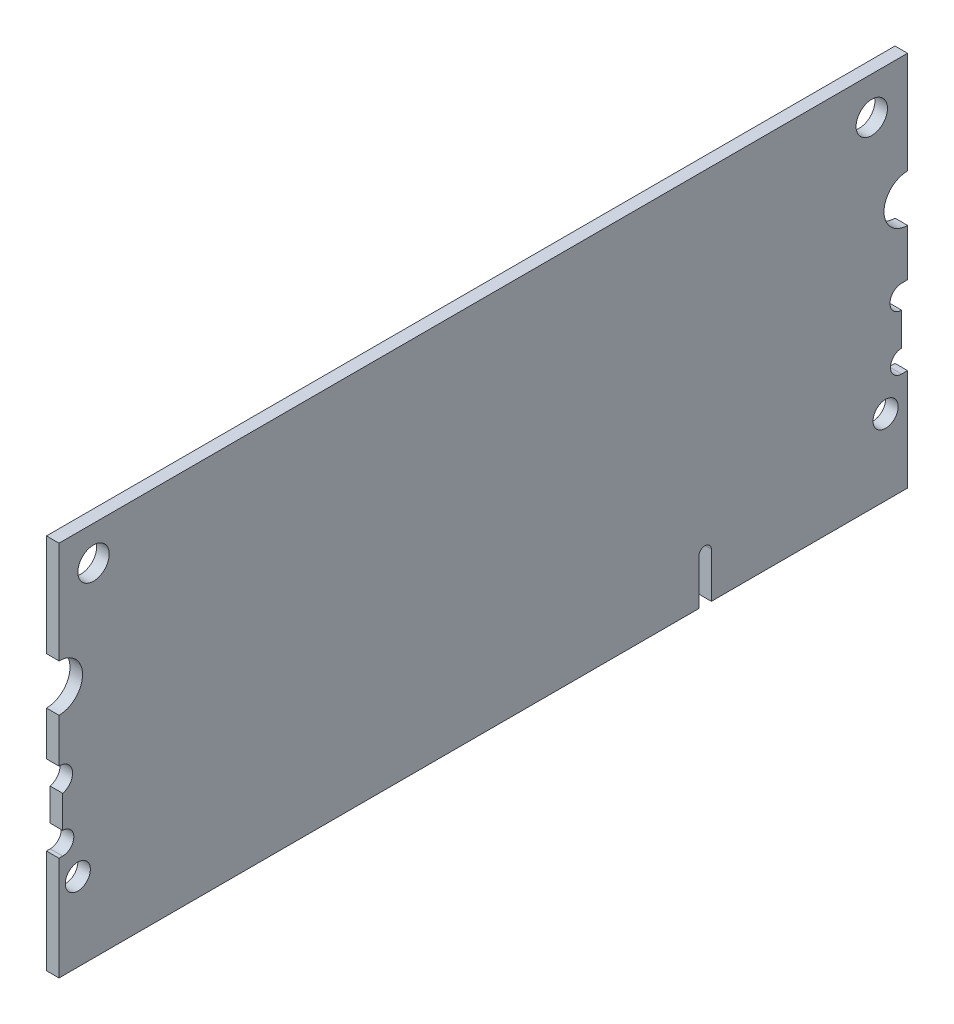
ISO-10303-21;
HEADER;
FILE_DESCRIPTION(('STEP AP214'),'2;1');
FILE_NAME('part.step','',(''),(''),'','','');
FILE_SCHEMA(('AUTOMOTIVE_DESIGN { 1 0 10303 214 1 1 1 1 }'));
ENDSEC;
DATA;
#1=APPLICATION_CONTEXT('core data for automotive mechanical design processes');
#2=APPLICATION_PROTOCOL_DEFINITION('international standard','automotive_design',2000,#1);
#3=PRODUCT_CONTEXT('',#1,'mechanical');
#4=PRODUCT('Part','Part','',(#3));
#5=PRODUCT_RELATED_PRODUCT_CATEGORY('part','',(#4));
#6=PRODUCT_DEFINITION_FORMATION('','',#4);
#7=PRODUCT_DEFINITION_CONTEXT('part definition',#1,'design');
#8=PRODUCT_DEFINITION('design','',#6,#7);
#9=PRODUCT_DEFINITION_SHAPE('','',#8);
#10=(LENGTH_UNIT() NAMED_UNIT(*) SI_UNIT(.MILLI.,.METRE.));
#11=(NAMED_UNIT(*) PLANE_ANGLE_UNIT() SI_UNIT($,.RADIAN.));
#12=(NAMED_UNIT(*) SI_UNIT($,.STERADIAN.) SOLID_ANGLE_UNIT());
#13=UNCERTAINTY_MEASURE_WITH_UNIT(LENGTH_MEASURE(1.E-05),#10,'distance_accuracy_value','');
#14=(GEOMETRIC_REPRESENTATION_CONTEXT(3) GLOBAL_UNCERTAINTY_ASSIGNED_CONTEXT((#13)) GLOBAL_UNIT_ASSIGNED_CONTEXT((#10,
#11,#12)) REPRESENTATION_CONTEXT('',''));
#15=CARTESIAN_POINT('',(0.,0.,0.));
#16=DIRECTION('',(0.,0.,1.));
#17=DIRECTION('',(1.,0.,0.));
#18=AXIS2_PLACEMENT_3D('',#15,#16,#17);
#19=CARTESIAN_POINT('',(0.,20.,-67.6));
#20=DIRECTION('',(1.,0.,0.));
#21=DIRECTION('',(0.,0.,-1.));
#22=AXIS2_PLACEMENT_3D('',#19,#20,#21);
#23=CYLINDRICAL_SURFACE('',#22,1.875);
#24=DIRECTION('',(-1.,0.,0.));
#25=VECTOR('',#24,1.);
#26=CARTESIAN_POINT('',(0.,21.875,-67.6));
#27=LINE('',#26,#25);
#28=CARTESIAN_POINT('',(1.,21.875,-67.6));
#29=VERTEX_POINT('',#28);
#30=CARTESIAN_POINT('',(0.,21.875,-67.6));
#31=VERTEX_POINT('',#30);
#32=EDGE_CURVE('E213',#29,#31,#27,.T.);
#33=ORIENTED_EDGE('',*,*,#32,.F.);
#34=CARTESIAN_POINT('',(1.,20.,-67.6));
#35=DIRECTION('',(-1.,0.,0.));
#36=DIRECTION('',(0.,0.,-1.));
#37=AXIS2_PLACEMENT_3D('',#34,#35,#36);
#38=CIRCLE('',#37,1.875);
#39=CARTESIAN_POINT('',(1.,18.125,-67.6));
#40=VERTEX_POINT('',#39);
#41=EDGE_CURVE('E68',#40,#29,#38,.T.);
#42=ORIENTED_EDGE('',*,*,#41,.F.);
#43=DIRECTION('',(1.,0.,0.));
#44=VECTOR('',#43,1.);
#45=CARTESIAN_POINT('',(0.,18.125,-67.6));
#46=LINE('',#45,#44);
#47=CARTESIAN_POINT('',(0.,18.125,-67.6));
#48=VERTEX_POINT('',#47);
#49=EDGE_CURVE('E306',#48,#40,#46,.T.);
#50=ORIENTED_EDGE('',*,*,#49,.F.);
#51=CARTESIAN_POINT('',(0.,20.,-67.6));
#52=DIRECTION('',(1.,0.,0.));
#53=DIRECTION('',(0.,0.,-1.));
#54=AXIS2_PLACEMENT_3D('',#51,#52,#53);
#55=CIRCLE('',#54,1.875);
#56=EDGE_CURVE('E211',#31,#48,#55,.T.);
#57=ORIENTED_EDGE('',*,*,#56,.F.);
#58=EDGE_LOOP('',(#33,#42,#50,#57));
#59=FACE_BOUND('',#58,.T.);
#60=ADVANCED_FACE('F44',(#59),#23,.F.);
#61=CARTESIAN_POINT('',(0.,27.25,-2.75));
#62=DIRECTION('',(1.,0.,0.));
#63=DIRECTION('',(0.,0.,-1.));
#64=AXIS2_PLACEMENT_3D('',#61,#62,#63);
#65=CYLINDRICAL_SURFACE('',#64,1.25);
#66=CARTESIAN_POINT('',(1.,27.25,-2.75));
#67=DIRECTION('',(-1.,0.,0.));
#68=DIRECTION('',(0.,0.,-1.));
#69=AXIS2_PLACEMENT_3D('',#66,#67,#68);
#70=CIRCLE('',#69,1.25);
#71=CARTESIAN_POINT('',(1.,27.25,-1.5));
#72=VERTEX_POINT('',#71);
#73=EDGE_CURVE('E313',#72,#72,#70,.T.);
#74=ORIENTED_EDGE('',*,*,#73,.F.);
#75=EDGE_LOOP('',(#74));
#76=FACE_BOUND('',#75,.T.);
#77=CARTESIAN_POINT('',(0.,27.25,-2.75));
#78=DIRECTION('',(1.,0.,0.));
#79=DIRECTION('',(0.,0.,-1.));
#80=AXIS2_PLACEMENT_3D('',#77,#78,#79);
#81=CIRCLE('',#80,1.25);
#82=CARTESIAN_POINT('',(0.,27.25,-1.5));
#83=VERTEX_POINT('',#82);
#84=EDGE_CURVE('E310',#83,#83,#81,.T.);
#85=ORIENTED_EDGE('',*,*,#84,.F.);
#86=EDGE_LOOP('',(#85));
#87=FACE_BOUND('',#86,.T.);
#88=ADVANCED_FACE('F656',(#76,#87),#65,.F.);
#89=CARTESIAN_POINT('',(0.,3.59452729188019,-51.4698211262183));
#90=DIRECTION('',(1.,0.,0.));
#91=DIRECTION('',(0.,0.,1.));
#92=AXIS2_PLACEMENT_3D('',#89,#90,#91);
#93=CYLINDRICAL_SURFACE('',#92,0.500496891437328);
#94=CARTESIAN_POINT('',(0.,3.59452729188019,-51.4698211262183));
#95=DIRECTION('',(1.,0.,0.));
#96=DIRECTION('',(0.,0.,1.));
#97=AXIS2_PLACEMENT_3D('',#94,#95,#96);
#98=CIRCLE('',#97,0.500496891437328);
#99=CARTESIAN_POINT('',(0.,3.59452729188019,-51.9703180176556));
#100=VERTEX_POINT('',#99);
#101=CARTESIAN_POINT('',(0.,3.59452729188019,-50.969324234781));
#102=VERTEX_POINT('',#101);
#103=EDGE_CURVE('E227',#100,#102,#98,.T.);
#104=ORIENTED_EDGE('',*,*,#103,.F.);
#105=DIRECTION('',(1.,0.,0.));
#106=VECTOR('',#105,1.);
#107=CARTESIAN_POINT('',(0.,3.59452729188019,-51.9703180176556));
#108=LINE('',#107,#106);
#109=CARTESIAN_POINT('',(1.,3.59452729188019,-51.9703180176556));
#110=VERTEX_POINT('',#109);
#111=EDGE_CURVE('E11',#100,#110,#108,.T.);
#112=ORIENTED_EDGE('',*,*,#111,.T.);
#113=CARTESIAN_POINT('',(1.,3.59452729188019,-51.4698211262183));
#114=DIRECTION('',(-1.,0.,0.));
#115=DIRECTION('',(0.,0.,1.));
#116=AXIS2_PLACEMENT_3D('',#113,#114,#115);
#117=CIRCLE('',#116,0.500496891437328);
#118=CARTESIAN_POINT('',(1.,3.59452729188019,-50.969324234781));
#119=VERTEX_POINT('',#118);
#120=EDGE_CURVE('E176',#119,#110,#117,.T.);
#121=ORIENTED_EDGE('',*,*,#120,.F.);
#122=DIRECTION('',(1.,0.,0.));
#123=VECTOR('',#122,1.);
#124=CARTESIAN_POINT('',(0.,3.59452729188019,-50.969324234781));
#125=LINE('',#124,#123);
#126=EDGE_CURVE('E55',#102,#119,#125,.T.);
#127=ORIENTED_EDGE('',*,*,#126,.F.);
#128=EDGE_LOOP('',(#104,#112,#121,#127));
#129=FACE_BOUND('',#128,.T.);
#130=ADVANCED_FACE('F661',(#129),#93,.F.);
#131=CARTESIAN_POINT('',(0.,0.,-51.9703180176556));
#132=DIRECTION('',(0.,0.,-1.));
#133=DIRECTION('',(0.,-1.,0.));
#134=AXIS2_PLACEMENT_3D('',#131,#132,#133);
#135=PLANE('',#134);
#136=DIRECTION('',(0.,1.,0.));
#137=VECTOR('',#136,1.);
#138=CARTESIAN_POINT('',(0.,7.5,-51.9703180176556));
#139=LINE('',#138,#137);
#140=CARTESIAN_POINT('',(0.,0.,-51.9703180176556));
#141=VERTEX_POINT('',#140);
#142=EDGE_CURVE('E185',#141,#100,#139,.T.);
#143=ORIENTED_EDGE('',*,*,#142,.F.);
#144=DIRECTION('',(-1.,0.,0.));
#145=VECTOR('',#144,1.);
#146=CARTESIAN_POINT('',(0.,0.,-51.9703180176556));
#147=LINE('',#146,#145);
#148=CARTESIAN_POINT('',(1.,0.,-51.9703180176556));
#149=VERTEX_POINT('',#148);
#150=EDGE_CURVE('E182',#149,#141,#147,.T.);
#151=ORIENTED_EDGE('',*,*,#150,.F.);
#152=DIRECTION('',(0.,-1.,0.));
#153=VECTOR('',#152,1.);
#154=CARTESIAN_POINT('',(1.,7.5,-51.9703180176556));
#155=LINE('',#154,#153);
#156=EDGE_CURVE('E167',#110,#149,#155,.T.);
#157=ORIENTED_EDGE('',*,*,#156,.F.);
#158=ORIENTED_EDGE('',*,*,#111,.F.);
#159=EDGE_LOOP('',(#143,#151,#157,#158));
#160=FACE_BOUND('',#159,.T.);
#161=ADVANCED_FACE('F183',(#160),#135,.F.);
#162=CARTESIAN_POINT('',(0.,3.59452729188019,-50.969324234781));
#163=DIRECTION('',(0.,0.,1.));
#164=DIRECTION('',(1.,0.,0.));
#165=AXIS2_PLACEMENT_3D('',#162,#163,#164);
#166=PLANE('',#165);
#167=DIRECTION('',(0.,-1.,0.));
#168=VECTOR('',#167,1.);
#169=CARTESIAN_POINT('',(0.,9.2972636459401,-50.969324234781));
#170=LINE('',#169,#168);
#171=CARTESIAN_POINT('',(0.,0.,-50.969324234781));
#172=VERTEX_POINT('',#171);
#173=EDGE_CURVE('E269',#102,#172,#170,.T.);
#174=ORIENTED_EDGE('',*,*,#173,.F.);
#175=ORIENTED_EDGE('',*,*,#126,.T.);
#176=DIRECTION('',(0.,1.,0.));
#177=VECTOR('',#176,1.);
#178=CARTESIAN_POINT('',(1.,9.2972636459401,-50.969324234781));
#179=LINE('',#178,#177);
#180=CARTESIAN_POINT('',(1.,0.,-50.969324234781));
#181=VERTEX_POINT('',#180);
#182=EDGE_CURVE('E48',#181,#119,#179,.T.);
#183=ORIENTED_EDGE('',*,*,#182,.F.);
#184=DIRECTION('',(1.,0.,0.));
#185=VECTOR('',#184,1.);
#186=CARTESIAN_POINT('',(0.,0.,-50.969324234781));
#187=LINE('',#186,#185);
#188=EDGE_CURVE('E245',#172,#181,#187,.T.);
#189=ORIENTED_EDGE('',*,*,#188,.F.);
#190=EDGE_LOOP('',(#174,#175,#183,#189));
#191=FACE_BOUND('',#190,.T.);
#192=ADVANCED_FACE('F693',(#191),#166,.F.);
#193=CARTESIAN_POINT('',(0.,6.,-65.85));
#194=DIRECTION('',(1.,0.,0.));
#195=DIRECTION('',(0.,0.,-1.));
#196=AXIS2_PLACEMENT_3D('',#193,#194,#195);
#197=CYLINDRICAL_SURFACE('',#196,1.);
#198=CARTESIAN_POINT('',(1.,6.,-65.85));
#199=DIRECTION('',(-1.,0.,0.));
#200=DIRECTION('',(0.,0.,-1.));
#201=AXIS2_PLACEMENT_3D('',#198,#199,#200);
#202=CIRCLE('',#201,1.);
#203=CARTESIAN_POINT('',(1.,6.,-64.85));
#204=VERTEX_POINT('',#203);
#205=EDGE_CURVE('E317',#204,#204,#202,.T.);
#206=ORIENTED_EDGE('',*,*,#205,.F.);
#207=EDGE_LOOP('',(#206));
#208=FACE_BOUND('',#207,.T.);
#209=CARTESIAN_POINT('',(0.,6.,-65.85));
#210=DIRECTION('',(1.,0.,0.));
#211=DIRECTION('',(0.,0.,-1.));
#212=AXIS2_PLACEMENT_3D('',#209,#210,#211);
#213=CIRCLE('',#212,1.);
#214=CARTESIAN_POINT('',(0.,6.,-64.85));
#215=VERTEX_POINT('',#214);
#216=EDGE_CURVE('E353',#215,#215,#213,.T.);
#217=ORIENTED_EDGE('',*,*,#216,.F.);
#218=EDGE_LOOP('',(#217));
#219=FACE_BOUND('',#218,.T.);
#220=ADVANCED_FACE('F677',(#208,#219),#197,.F.);
#221=CARTESIAN_POINT('',(0.,6.25,-1.5));
#222=DIRECTION('',(1.,0.,0.));
#223=DIRECTION('',(0.,0.,-1.));
#224=AXIS2_PLACEMENT_3D('',#221,#222,#223);
#225=CYLINDRICAL_SURFACE('',#224,1.);
#226=CARTESIAN_POINT('',(1.,6.25,-1.5));
#227=DIRECTION('',(-1.,0.,0.));
#228=DIRECTION('',(0.,0.,-1.));
#229=AXIS2_PLACEMENT_3D('',#226,#227,#228);
#230=CIRCLE('',#229,1.);
#231=CARTESIAN_POINT('',(1.,6.25,-0.5));
#232=VERTEX_POINT('',#231);
#233=EDGE_CURVE('E403',#232,#232,#230,.T.);
#234=ORIENTED_EDGE('',*,*,#233,.F.);
#235=EDGE_LOOP('',(#234));
#236=FACE_BOUND('',#235,.T.);
#237=CARTESIAN_POINT('',(0.,6.25,-1.5));
#238=DIRECTION('',(1.,0.,0.));
#239=DIRECTION('',(0.,0.,-1.));
#240=AXIS2_PLACEMENT_3D('',#237,#238,#239);
#241=CIRCLE('',#240,1.);
#242=CARTESIAN_POINT('',(0.,6.25,-0.5));
#243=VERTEX_POINT('',#242);
#244=EDGE_CURVE('E349',#243,#243,#241,.T.);
#245=ORIENTED_EDGE('',*,*,#244,.F.);
#246=EDGE_LOOP('',(#245));
#247=FACE_BOUND('',#246,.T.);
#248=ADVANCED_FACE('F673',(#236,#247),#225,.F.);
#249=CARTESIAN_POINT('',(0.,14.6156215378988,-0.0558764284634614));
#250=DIRECTION('',(0.,1.,0.));
#251=DIRECTION('',(1.,0.,0.));
#252=AXIS2_PLACEMENT_3D('',#249,#250,#251);
#253=PLANE('',#252);
#254=DIRECTION('',(0.,0.,1.));
#255=VECTOR('',#254,1.);
#256=CARTESIAN_POINT('',(0.,14.6156215378988,-16.9279382142317));
#257=LINE('',#256,#255);
#258=CARTESIAN_POINT('',(0.,14.6156215378988,-0.0558764284634614));
#259=VERTEX_POINT('',#258);
#260=CARTESIAN_POINT('',(0.,14.6156215378988,0.));
#261=VERTEX_POINT('',#260);
#262=EDGE_CURVE('E426',#259,#261,#257,.T.);
#263=ORIENTED_EDGE('',*,*,#262,.F.);
#264=DIRECTION('',(1.,0.,0.));
#265=VECTOR('',#264,1.);
#266=CARTESIAN_POINT('',(0.,14.6156215378988,-0.0558764284634614));
#267=LINE('',#266,#265);
#268=CARTESIAN_POINT('',(1.,14.6156215378988,-0.0558764284634614));
#269=VERTEX_POINT('',#268);
#270=EDGE_CURVE('E237',#259,#269,#267,.T.);
#271=ORIENTED_EDGE('',*,*,#270,.T.);
#272=DIRECTION('',(0.,0.,-1.));
#273=VECTOR('',#272,1.);
#274=CARTESIAN_POINT('',(1.,14.6156215378988,-16.9279382142317));
#275=LINE('',#274,#273);
#276=CARTESIAN_POINT('',(1.,14.6156215378988,0.));
#277=VERTEX_POINT('',#276);
#278=EDGE_CURVE('E228',#277,#269,#275,.T.);
#279=ORIENTED_EDGE('',*,*,#278,.F.);
#280=DIRECTION('',(1.,0.,0.));
#281=VECTOR('',#280,1.);
#282=CARTESIAN_POINT('',(0.,14.6156215378988,0.));
#283=LINE('',#282,#281);
#284=EDGE_CURVE('E241',#261,#277,#283,.T.);
#285=ORIENTED_EDGE('',*,*,#284,.F.);
#286=EDGE_LOOP('',(#263,#271,#279,#285));
#287=FACE_BOUND('',#286,.T.);
#288=ADVANCED_FACE('F676',(#287),#253,.F.);
#289=CARTESIAN_POINT('',(0.,13.5910572090062,-0.0558764284634613));
#290=DIRECTION('',(1.,0.,0.));
#291=DIRECTION('',(0.,1.,0.));
#292=AXIS2_PLACEMENT_3D('',#289,#290,#291);
#293=CYLINDRICAL_SURFACE('',#292,1.02456432889257);
#294=CARTESIAN_POINT('',(0.,13.5910572090062,-0.0558764284634613));
#295=DIRECTION('',(1.,0.,0.));
#296=DIRECTION('',(0.,1.,0.));
#297=AXIS2_PLACEMENT_3D('',#294,#295,#296);
#298=CIRCLE('',#297,1.02456432889257);
#299=CARTESIAN_POINT('',(0.,12.594860961696,-0.295303037018298));
#300=VERTEX_POINT('',#299);
#301=EDGE_CURVE('E286',#300,#259,#298,.T.);
#302=ORIENTED_EDGE('',*,*,#301,.F.);
#303=DIRECTION('',(1.,0.,0.));
#304=VECTOR('',#303,1.);
#305=CARTESIAN_POINT('',(0.,12.594860961696,-0.295303037018298));
#306=LINE('',#305,#304);
#307=CARTESIAN_POINT('',(1.,12.594860961696,-0.295303037018298));
#308=VERTEX_POINT('',#307);
#309=EDGE_CURVE('E249',#300,#308,#306,.T.);
#310=ORIENTED_EDGE('',*,*,#309,.T.);
#311=CARTESIAN_POINT('',(1.,13.5910572090062,-0.0558764284634613));
#312=DIRECTION('',(-1.,0.,0.));
#313=DIRECTION('',(0.,1.,0.));
#314=AXIS2_PLACEMENT_3D('',#311,#312,#313);
#315=CIRCLE('',#314,1.02456432889257);
#316=EDGE_CURVE('E233',#269,#308,#315,.T.);
#317=ORIENTED_EDGE('',*,*,#316,.F.);
#318=ORIENTED_EDGE('',*,*,#270,.F.);
#319=EDGE_LOOP('',(#302,#310,#317,#318));
#320=FACE_BOUND('',#319,.T.);
#321=ADVANCED_FACE('F682',(#320),#293,.F.);
#322=CARTESIAN_POINT('',(0.,10.0343910374848,-0.295303037018298));
#323=DIRECTION('',(0.,0.,-1.));
#324=DIRECTION('',(0.,-1.,0.));
#325=AXIS2_PLACEMENT_3D('',#322,#323,#324);
#326=PLANE('',#325);
#327=DIRECTION('',(0.,1.,0.));
#328=VECTOR('',#327,1.);
#329=CARTESIAN_POINT('',(0.,12.5171955187424,-0.2953030370183));
#330=LINE('',#329,#328);
#331=CARTESIAN_POINT('',(0.,10.0343910374848,-0.295303037018298));
#332=VERTEX_POINT('',#331);
#333=EDGE_CURVE('E281',#332,#300,#330,.T.);
#334=ORIENTED_EDGE('',*,*,#333,.F.);
#335=DIRECTION('',(1.,0.,0.));
#336=VECTOR('',#335,1.);
#337=CARTESIAN_POINT('',(0.,10.0343910374848,-0.295303037018298));
#338=LINE('',#337,#336);
#339=CARTESIAN_POINT('',(1.,10.0343910374848,-0.295303037018298));
#340=VERTEX_POINT('',#339);
#341=EDGE_CURVE('E605',#332,#340,#338,.T.);
#342=ORIENTED_EDGE('',*,*,#341,.T.);
#343=DIRECTION('',(0.,-1.,0.));
#344=VECTOR('',#343,1.);
#345=CARTESIAN_POINT('',(1.,12.5171955187424,-0.2953030370183));
#346=LINE('',#345,#344);
#347=EDGE_CURVE('E345',#308,#340,#346,.T.);
#348=ORIENTED_EDGE('',*,*,#347,.F.);
#349=ORIENTED_EDGE('',*,*,#309,.F.);
#350=EDGE_LOOP('',(#334,#342,#348,#349));
#351=FACE_BOUND('',#350,.T.);
#352=ADVANCED_FACE('F603',(#351),#326,.F.);
#353=CARTESIAN_POINT('',(0.,9.14899907075078,-0.295303037018298));
#354=DIRECTION('',(1.,0.,0.));
#355=DIRECTION('',(0.,1.,0.));
#356=AXIS2_PLACEMENT_3D('',#353,#354,#355);
#357=CYLINDRICAL_SURFACE('',#356,0.885391966734013);
#358=CARTESIAN_POINT('',(0.,9.14899907075078,-0.295303037018298));
#359=DIRECTION('',(1.,0.,0.));
#360=DIRECTION('',(0.,1.,0.));
#361=AXIS2_PLACEMENT_3D('',#358,#359,#360);
#362=CIRCLE('',#361,0.885391966734013);
#363=CARTESIAN_POINT('',(0.,8.26360710401677,-0.295303037018298));
#364=VERTEX_POINT('',#363);
#365=EDGE_CURVE('E285',#364,#332,#362,.T.);
#366=ORIENTED_EDGE('',*,*,#365,.F.);
#367=DIRECTION('',(1.,0.,0.));
#368=VECTOR('',#367,1.);
#369=CARTESIAN_POINT('',(0.,8.26360710401677,-0.295303037018298));
#370=LINE('',#369,#368);
#371=CARTESIAN_POINT('',(1.,8.26360710401677,-0.295303037018298));
#372=VERTEX_POINT('',#371);
#373=EDGE_CURVE('E387',#364,#372,#370,.T.);
#374=ORIENTED_EDGE('',*,*,#373,.T.);
#375=CARTESIAN_POINT('',(1.,9.14899907075078,-0.295303037018298));
#376=DIRECTION('',(-1.,0.,0.));
#377=DIRECTION('',(0.,1.,0.));
#378=AXIS2_PLACEMENT_3D('',#375,#376,#377);
#379=CIRCLE('',#378,0.885391966734013);
#380=EDGE_CURVE('E393',#340,#372,#379,.T.);
#381=ORIENTED_EDGE('',*,*,#380,.F.);
#382=ORIENTED_EDGE('',*,*,#341,.F.);
#383=EDGE_LOOP('',(#366,#374,#381,#382));
#384=FACE_BOUND('',#383,.T.);
#385=ADVANCED_FACE('F610',(#384),#357,.F.);
#386=CARTESIAN_POINT('',(0.,8.26360710401677,0.));
#387=DIRECTION('',(0.,-1.,0.));
#388=DIRECTION('',(0.,0.,-1.));
#389=AXIS2_PLACEMENT_3D('',#386,#387,#388);
#390=PLANE('',#389);
#391=DIRECTION('',(0.,0.,-1.));
#392=VECTOR('',#391,1.);
#393=CARTESIAN_POINT('',(0.,8.26360710401677,-16.9));
#394=LINE('',#393,#392);
#395=CARTESIAN_POINT('',(0.,8.26360710401677,0.));
#396=VERTEX_POINT('',#395);
#397=EDGE_CURVE('E430',#396,#364,#394,.T.);
#398=ORIENTED_EDGE('',*,*,#397,.F.);
#399=DIRECTION('',(-1.,0.,0.));
#400=VECTOR('',#399,1.);
#401=CARTESIAN_POINT('',(0.,8.26360710401677,0.));
#402=LINE('',#401,#400);
#403=CARTESIAN_POINT('',(1.,8.26360710401677,0.));
#404=VERTEX_POINT('',#403);
#405=EDGE_CURVE('E261',#404,#396,#402,.T.);
#406=ORIENTED_EDGE('',*,*,#405,.F.);
#407=DIRECTION('',(0.,0.,1.));
#408=VECTOR('',#407,1.);
#409=CARTESIAN_POINT('',(1.,8.26360710401677,-16.9));
#410=LINE('',#409,#408);
#411=EDGE_CURVE('E322',#372,#404,#410,.T.);
#412=ORIENTED_EDGE('',*,*,#411,.F.);
#413=ORIENTED_EDGE('',*,*,#373,.F.);
#414=EDGE_LOOP('',(#398,#406,#412,#413));
#415=FACE_BOUND('',#414,.T.);
#416=ADVANCED_FACE('F618',(#415),#390,.F.);
#417=CARTESIAN_POINT('',(0.,8.99825314350814,-67.1303473751808));
#418=DIRECTION('',(1.,0.,0.));
#419=DIRECTION('',(0.,-1.,0.));
#420=AXIS2_PLACEMENT_3D('',#417,#418,#419);
#421=CYLINDRICAL_SURFACE('',#420,0.892058409525503);
#422=CARTESIAN_POINT('',(0.,8.99825314350814,-67.1303473751808));
#423=DIRECTION('',(1.,0.,0.));
#424=DIRECTION('',(0.,-1.,0.));
#425=AXIS2_PLACEMENT_3D('',#422,#423,#424);
#426=CIRCLE('',#425,0.892058409525503);
#427=CARTESIAN_POINT('',(0.,9.89031155303364,-67.1303473751808));
#428=VERTEX_POINT('',#427);
#429=CARTESIAN_POINT('',(0.,8.10619473398264,-67.1303473751808));
#430=VERTEX_POINT('',#429);
#431=EDGE_CURVE('E419',#428,#430,#426,.T.);
#432=ORIENTED_EDGE('',*,*,#431,.F.);
#433=DIRECTION('',(1.,0.,0.));
#434=VECTOR('',#433,1.);
#435=CARTESIAN_POINT('',(0.,9.89031155303364,-67.1303473751808));
#436=LINE('',#435,#434);
#437=CARTESIAN_POINT('',(1.,9.89031155303364,-67.1303473751808));
#438=VERTEX_POINT('',#437);
#439=EDGE_CURVE('E389',#428,#438,#436,.T.);
#440=ORIENTED_EDGE('',*,*,#439,.T.);
#441=CARTESIAN_POINT('',(1.,8.99825314350814,-67.1303473751808));
#442=DIRECTION('',(-1.,0.,0.));
#443=DIRECTION('',(0.,-1.,0.));
#444=AXIS2_PLACEMENT_3D('',#441,#442,#443);
#445=CIRCLE('',#444,0.892058409525503);
#446=CARTESIAN_POINT('',(1.,8.10619473398264,-67.1303473751808));
#447=VERTEX_POINT('',#446);
#448=EDGE_CURVE('E295',#447,#438,#445,.T.);
#449=ORIENTED_EDGE('',*,*,#448,.F.);
#450=DIRECTION('',(1.,0.,0.));
#451=VECTOR('',#450,1.);
#452=CARTESIAN_POINT('',(0.,8.10619473398264,-67.1303473751808));
#453=LINE('',#452,#451);
#454=EDGE_CURVE('E189',#430,#447,#453,.T.);
#455=ORIENTED_EDGE('',*,*,#454,.F.);
#456=EDGE_LOOP('',(#432,#440,#449,#455));
#457=FACE_BOUND('',#456,.T.);
#458=ADVANCED_FACE('F705',(#457),#421,.F.);
#459=CARTESIAN_POINT('',(0.,12.5105135780512,-67.1303473751808));
#460=DIRECTION('',(0.,0.,1.));
#461=DIRECTION('',(1.,0.,0.));
#462=AXIS2_PLACEMENT_3D('',#459,#460,#461);
#463=PLANE('',#462);
#464=DIRECTION('',(0.,-1.,0.));
#465=VECTOR('',#464,1.);
#466=CARTESIAN_POINT('',(0.,13.7552567890256,-67.1303473751808));
#467=LINE('',#466,#465);
#468=CARTESIAN_POINT('',(0.,12.5105135780512,-67.1303473751808));
#469=VERTEX_POINT('',#468);
#470=EDGE_CURVE('E302',#469,#428,#467,.T.);
#471=ORIENTED_EDGE('',*,*,#470,.F.);
#472=DIRECTION('',(1.,0.,0.));
#473=VECTOR('',#472,1.);
#474=CARTESIAN_POINT('',(0.,12.5105135780512,-67.1303473751808));
#475=LINE('',#474,#473);
#476=CARTESIAN_POINT('',(1.,12.5105135780512,-67.1303473751808));
#477=VERTEX_POINT('',#476);
#478=EDGE_CURVE('E223',#469,#477,#475,.T.);
#479=ORIENTED_EDGE('',*,*,#478,.T.);
#480=DIRECTION('',(0.,1.,0.));
#481=VECTOR('',#480,1.);
#482=CARTESIAN_POINT('',(1.,13.7552567890256,-67.1303473751808));
#483=LINE('',#482,#481);
#484=EDGE_CURVE('E279',#438,#477,#483,.T.);
#485=ORIENTED_EDGE('',*,*,#484,.F.);
#486=ORIENTED_EDGE('',*,*,#439,.F.);
#487=EDGE_LOOP('',(#471,#479,#485,#486));
#488=FACE_BOUND('',#487,.T.);
#489=ADVANCED_FACE('F46',(#488),#463,.F.);
#490=CARTESIAN_POINT('',(0.,13.4411982862408,-67.1303473751808));
#491=DIRECTION('',(1.,0.,0.));
#492=DIRECTION('',(0.,-1.,0.));
#493=AXIS2_PLACEMENT_3D('',#490,#491,#492);
#494=CYLINDRICAL_SURFACE('',#493,0.930684708189624);
#495=CARTESIAN_POINT('',(0.,13.4411982862408,-67.1303473751808));
#496=DIRECTION('',(1.,0.,0.));
#497=DIRECTION('',(0.,-1.,0.));
#498=AXIS2_PLACEMENT_3D('',#495,#496,#497);
#499=CIRCLE('',#498,0.930684708189624);
#500=CARTESIAN_POINT('',(0.,14.3718829944304,-67.1303473751808));
#501=VERTEX_POINT('',#500);
#502=EDGE_CURVE('E298',#501,#469,#499,.T.);
#503=ORIENTED_EDGE('',*,*,#502,.F.);
#504=DIRECTION('',(1.,0.,0.));
#505=VECTOR('',#504,1.);
#506=CARTESIAN_POINT('',(0.,14.3718829944304,-67.1303473751808));
#507=LINE('',#506,#505);
#508=CARTESIAN_POINT('',(1.,14.3718829944304,-67.1303473751808));
#509=VERTEX_POINT('',#508);
#510=EDGE_CURVE('E219',#501,#509,#507,.T.);
#511=ORIENTED_EDGE('',*,*,#510,.T.);
#512=CARTESIAN_POINT('',(1.,13.4411982862408,-67.1303473751808));
#513=DIRECTION('',(-1.,0.,0.));
#514=DIRECTION('',(0.,-1.,0.));
#515=AXIS2_PLACEMENT_3D('',#512,#513,#514);
#516=CIRCLE('',#515,0.930684708189624);
#517=EDGE_CURVE('E275',#477,#509,#516,.T.);
#518=ORIENTED_EDGE('',*,*,#517,.F.);
#519=ORIENTED_EDGE('',*,*,#478,.F.);
#520=EDGE_LOOP('',(#503,#511,#518,#519));
#521=FACE_BOUND('',#520,.T.);
#522=ADVANCED_FACE('F461',(#521),#494,.F.);
#523=CARTESIAN_POINT('',(0.,14.3718829944304,-67.6));
#524=DIRECTION('',(0.,1.,0.));
#525=DIRECTION('',(1.,0.,0.));
#526=AXIS2_PLACEMENT_3D('',#523,#524,#525);
#527=PLANE('',#526);
#528=DIRECTION('',(0.,0.,1.));
#529=VECTOR('',#528,1.);
#530=CARTESIAN_POINT('',(0.,14.3718829944304,-50.7));
#531=LINE('',#530,#529);
#532=CARTESIAN_POINT('',(0.,14.3718829944304,-67.6));
#533=VERTEX_POINT('',#532);
#534=EDGE_CURVE('E212',#533,#501,#531,.T.);
#535=ORIENTED_EDGE('',*,*,#534,.F.);
#536=DIRECTION('',(-1.,0.,0.));
#537=VECTOR('',#536,1.);
#538=CARTESIAN_POINT('',(0.,14.3718829944304,-67.6));
#539=LINE('',#538,#537);
#540=CARTESIAN_POINT('',(1.,14.3718829944304,-67.6));
#541=VERTEX_POINT('',#540);
#542=EDGE_CURVE('E260',#541,#533,#539,.T.);
#543=ORIENTED_EDGE('',*,*,#542,.F.);
#544=DIRECTION('',(0.,0.,-1.));
#545=VECTOR('',#544,1.);
#546=CARTESIAN_POINT('',(1.,14.3718829944304,-50.7));
#547=LINE('',#546,#545);
#548=EDGE_CURVE('E280',#509,#541,#547,.T.);
#549=ORIENTED_EDGE('',*,*,#548,.F.);
#550=ORIENTED_EDGE('',*,*,#510,.F.);
#551=EDGE_LOOP('',(#535,#543,#549,#550));
#552=FACE_BOUND('',#551,.T.);
#553=ADVANCED_FACE('F643',(#552),#527,.F.);
#554=CARTESIAN_POINT('',(0.,8.10619473398264,-67.1303473751808));
#555=DIRECTION('',(0.,-1.,0.));
#556=DIRECTION('',(0.,0.,-1.));
#557=AXIS2_PLACEMENT_3D('',#554,#555,#556);
#558=PLANE('',#557);
#559=DIRECTION('',(0.,0.,-1.));
#560=VECTOR('',#559,1.);
#561=CARTESIAN_POINT('',(0.,8.10619473398264,-50.4651736875904));
#562=LINE('',#561,#560);
#563=CARTESIAN_POINT('',(0.,8.10619473398264,-67.6));
#564=VERTEX_POINT('',#563);
#565=EDGE_CURVE('E274',#430,#564,#562,.T.);
#566=ORIENTED_EDGE('',*,*,#565,.F.);
#567=ORIENTED_EDGE('',*,*,#454,.T.);
#568=DIRECTION('',(0.,0.,1.));
#569=VECTOR('',#568,1.);
#570=CARTESIAN_POINT('',(1.,8.10619473398264,-50.4651736875904));
#571=LINE('',#570,#569);
#572=CARTESIAN_POINT('',(1.,8.10619473398264,-67.6));
#573=VERTEX_POINT('',#572);
#574=EDGE_CURVE('E202',#573,#447,#571,.T.);
#575=ORIENTED_EDGE('',*,*,#574,.F.);
#576=DIRECTION('',(1.,0.,0.));
#577=VECTOR('',#576,1.);
#578=CARTESIAN_POINT('',(0.,8.10619473398264,-67.6));
#579=LINE('',#578,#577);
#580=EDGE_CURVE('E341',#564,#573,#579,.T.);
#581=ORIENTED_EDGE('',*,*,#580,.F.);
#582=EDGE_LOOP('',(#566,#567,#575,#581));
#583=FACE_BOUND('',#582,.T.);
#584=ADVANCED_FACE('F376',(#583),#558,.F.);
#585=CARTESIAN_POINT('',(0.,20.,0.));
#586=DIRECTION('',(1.,0.,0.));
#587=DIRECTION('',(0.,0.,-1.));
#588=AXIS2_PLACEMENT_3D('',#585,#586,#587);
#589=CYLINDRICAL_SURFACE('',#588,1.875);
#590=DIRECTION('',(1.,0.,0.));
#591=VECTOR('',#590,1.);
#592=CARTESIAN_POINT('',(0.,21.875,0.));
#593=LINE('',#592,#591);
#594=CARTESIAN_POINT('',(0.,21.875,0.));
#595=VERTEX_POINT('',#594);
#596=CARTESIAN_POINT('',(1.,21.875,0.));
#597=VERTEX_POINT('',#596);
#598=EDGE_CURVE('E256',#595,#597,#593,.T.);
#599=ORIENTED_EDGE('',*,*,#598,.F.);
#600=CARTESIAN_POINT('',(0.,20.,0.));
#601=DIRECTION('',(1.,0.,0.));
#602=DIRECTION('',(0.,0.,-1.));
#603=AXIS2_PLACEMENT_3D('',#600,#601,#602);
#604=CIRCLE('',#603,1.875);
#605=CARTESIAN_POINT('',(0.,18.125,0.));
#606=VERTEX_POINT('',#605);
#607=EDGE_CURVE('E338',#606,#595,#604,.T.);
#608=ORIENTED_EDGE('',*,*,#607,.F.);
#609=DIRECTION('',(-1.,0.,0.));
#610=VECTOR('',#609,1.);
#611=CARTESIAN_POINT('',(0.,18.125,0.));
#612=LINE('',#611,#610);
#613=CARTESIAN_POINT('',(1.,18.125,0.));
#614=VERTEX_POINT('',#613);
#615=EDGE_CURVE('E238',#614,#606,#612,.T.);
#616=ORIENTED_EDGE('',*,*,#615,.F.);
#617=CARTESIAN_POINT('',(1.,20.,0.));
#618=DIRECTION('',(-1.,0.,0.));
#619=DIRECTION('',(0.,0.,-1.));
#620=AXIS2_PLACEMENT_3D('',#617,#618,#619);
#621=CIRCLE('',#620,1.875);
#622=EDGE_CURVE('E328',#597,#614,#621,.T.);
#623=ORIENTED_EDGE('',*,*,#622,.F.);
#624=EDGE_LOOP('',(#599,#608,#616,#623));
#625=FACE_BOUND('',#624,.T.);
#626=ADVANCED_FACE('F650',(#625),#589,.F.);
#627=CARTESIAN_POINT('',(0.,0.,0.));
#628=DIRECTION('',(0.,-1.,0.));
#629=DIRECTION('',(0.,0.,-1.));
#630=AXIS2_PLACEMENT_3D('',#627,#628,#629);
#631=PLANE('',#630);
#632=ORIENTED_EDGE('',*,*,#150,.T.);
#633=DIRECTION('',(0.,0.,1.));
#634=VECTOR('',#633,1.);
#635=CARTESIAN_POINT('',(0.,0.,-67.6));
#636=LINE('',#635,#634);
#637=CARTESIAN_POINT('',(0.,0.,-67.6));
#638=VERTEX_POINT('',#637);
#639=EDGE_CURVE('E226',#638,#141,#636,.T.);
#640=ORIENTED_EDGE('',*,*,#639,.F.);
#641=DIRECTION('',(1.,0.,0.));
#642=VECTOR('',#641,1.);
#643=CARTESIAN_POINT('',(0.,0.,-67.6));
#644=LINE('',#643,#642);
#645=CARTESIAN_POINT('',(1.,0.,-67.6));
#646=VERTEX_POINT('',#645);
#647=EDGE_CURVE('E190',#638,#646,#644,.T.);
#648=ORIENTED_EDGE('',*,*,#647,.T.);
#649=DIRECTION('',(0.,0.,-1.));
#650=VECTOR('',#649,1.);
#651=CARTESIAN_POINT('',(1.,0.,-67.6));
#652=LINE('',#651,#650);
#653=EDGE_CURVE('E173',#149,#646,#652,.T.);
#654=ORIENTED_EDGE('',*,*,#653,.F.);
#655=EDGE_LOOP('',(#632,#640,#648,#654));
#656=FACE_BOUND('',#655,.T.);
#657=ADVANCED_FACE('F192',(#656),#631,.T.);
#658=CARTESIAN_POINT('',(0.,0.,-67.6));
#659=DIRECTION('',(0.,0.,-1.));
#660=DIRECTION('',(0.,-1.,0.));
#661=AXIS2_PLACEMENT_3D('',#658,#659,#660);
#662=PLANE('',#661);
#663=ORIENTED_EDGE('',*,*,#580,.T.);
#664=DIRECTION('',(0.,1.,0.));
#665=VECTOR('',#664,1.);
#666=CARTESIAN_POINT('',(1.,30.,-67.6));
#667=LINE('',#666,#665);
#668=EDGE_CURVE('E196',#646,#573,#667,.T.);
#669=ORIENTED_EDGE('',*,*,#668,.F.);
#670=ORIENTED_EDGE('',*,*,#647,.F.);
#671=DIRECTION('',(0.,-1.,0.));
#672=VECTOR('',#671,1.);
#673=CARTESIAN_POINT('',(0.,30.,-67.6));
#674=LINE('',#673,#672);
#675=EDGE_CURVE('E270',#564,#638,#674,.T.);
#676=ORIENTED_EDGE('',*,*,#675,.F.);
#677=EDGE_LOOP('',(#663,#669,#670,#676));
#678=FACE_BOUND('',#677,.T.);
#679=ADVANCED_FACE('F367',(#678),#662,.T.);
#680=CARTESIAN_POINT('',(0.,0.,-67.6));
#681=DIRECTION('',(0.,0.,-1.));
#682=DIRECTION('',(0.,-1.,0.));
#683=AXIS2_PLACEMENT_3D('',#680,#681,#682);
#684=PLANE('',#683);
#685=ORIENTED_EDGE('',*,*,#49,.T.);
#686=DIRECTION('',(0.,1.,0.));
#687=VECTOR('',#686,1.);
#688=CARTESIAN_POINT('',(1.,30.,-67.6));
#689=LINE('',#688,#687);
#690=EDGE_CURVE('E294',#541,#40,#689,.T.);
#691=ORIENTED_EDGE('',*,*,#690,.F.);
#692=ORIENTED_EDGE('',*,*,#542,.T.);
#693=DIRECTION('',(0.,-1.,0.));
#694=VECTOR('',#693,1.);
#695=CARTESIAN_POINT('',(0.,30.,-67.6));
#696=LINE('',#695,#694);
#697=EDGE_CURVE('E208',#48,#533,#696,.T.);
#698=ORIENTED_EDGE('',*,*,#697,.F.);
#699=EDGE_LOOP('',(#685,#691,#692,#698));
#700=FACE_BOUND('',#699,.T.);
#701=ADVANCED_FACE('F537',(#700),#684,.T.);
#702=CARTESIAN_POINT('',(0.,30.,0.));
#703=DIRECTION('',(0.,0.,1.));
#704=DIRECTION('',(1.,0.,0.));
#705=AXIS2_PLACEMENT_3D('',#702,#703,#704);
#706=PLANE('',#705);
#707=ORIENTED_EDGE('',*,*,#598,.T.);
#708=DIRECTION('',(0.,-1.,0.));
#709=VECTOR('',#708,1.);
#710=CARTESIAN_POINT('',(1.,0.,0.));
#711=LINE('',#710,#709);
#712=CARTESIAN_POINT('',(1.,30.,0.));
#713=VERTEX_POINT('',#712);
#714=EDGE_CURVE('E324',#713,#597,#711,.T.);
#715=ORIENTED_EDGE('',*,*,#714,.F.);
#716=DIRECTION('',(1.,0.,0.));
#717=VECTOR('',#716,1.);
#718=CARTESIAN_POINT('',(0.,30.,0.));
#719=LINE('',#718,#717);
#720=CARTESIAN_POINT('',(0.,30.,0.));
#721=VERTEX_POINT('',#720);
#722=EDGE_CURVE('E217',#721,#713,#719,.T.);
#723=ORIENTED_EDGE('',*,*,#722,.F.);
#724=DIRECTION('',(0.,1.,0.));
#725=VECTOR('',#724,1.);
#726=CARTESIAN_POINT('',(0.,0.,0.));
#727=LINE('',#726,#725);
#728=EDGE_CURVE('E265',#595,#721,#727,.T.);
#729=ORIENTED_EDGE('',*,*,#728,.F.);
#730=EDGE_LOOP('',(#707,#715,#723,#729));
#731=FACE_BOUND('',#730,.T.);
#732=ADVANCED_FACE('F699',(#731),#706,.T.);
#733=CARTESIAN_POINT('',(0.,30.,0.));
#734=DIRECTION('',(0.,0.,1.));
#735=DIRECTION('',(1.,0.,0.));
#736=AXIS2_PLACEMENT_3D('',#733,#734,#735);
#737=PLANE('',#736);
#738=ORIENTED_EDGE('',*,*,#405,.T.);
#739=DIRECTION('',(0.,1.,0.));
#740=VECTOR('',#739,1.);
#741=CARTESIAN_POINT('',(0.,0.,0.));
#742=LINE('',#741,#740);
#743=CARTESIAN_POINT('',(0.,0.,0.));
#744=VERTEX_POINT('',#743);
#745=EDGE_CURVE('E408',#744,#396,#742,.T.);
#746=ORIENTED_EDGE('',*,*,#745,.F.);
#747=DIRECTION('',(1.,0.,0.));
#748=VECTOR('',#747,1.);
#749=CARTESIAN_POINT('',(0.,0.,0.));
#750=LINE('',#749,#748);
#751=CARTESIAN_POINT('',(1.,0.,0.));
#752=VERTEX_POINT('',#751);
#753=EDGE_CURVE('E206',#744,#752,#750,.T.);
#754=ORIENTED_EDGE('',*,*,#753,.T.);
#755=DIRECTION('',(0.,-1.,0.));
#756=VECTOR('',#755,1.);
#757=CARTESIAN_POINT('',(1.,0.,0.));
#758=LINE('',#757,#756);
#759=EDGE_CURVE('E318',#404,#752,#758,.T.);
#760=ORIENTED_EDGE('',*,*,#759,.F.);
#761=EDGE_LOOP('',(#738,#746,#754,#760));
#762=FACE_BOUND('',#761,.T.);
#763=ADVANCED_FACE('F622',(#762),#737,.T.);
#764=CARTESIAN_POINT('',(0.,15.,-33.8));
#765=DIRECTION('',(1.,0.,0.));
#766=DIRECTION('',(0.,1.,0.));
#767=AXIS2_PLACEMENT_3D('',#764,#765,#766);
#768=PLANE('',#767);
#769=ORIENTED_EDGE('',*,*,#84,.T.);
#770=EDGE_LOOP('',(#769));
#771=FACE_BOUND('',#770,.T.);
#772=ORIENTED_EDGE('',*,*,#216,.T.);
#773=EDGE_LOOP('',(#772));
#774=FACE_BOUND('',#773,.T.);
#775=ORIENTED_EDGE('',*,*,#244,.T.);
#776=EDGE_LOOP('',(#775));
#777=FACE_BOUND('',#776,.T.);
#778=CARTESIAN_POINT('',(0.,27.,-64.75));
#779=DIRECTION('',(1.,0.,0.));
#780=DIRECTION('',(0.,0.,-1.));
#781=AXIS2_PLACEMENT_3D('',#778,#779,#780);
#782=CIRCLE('',#781,1.25);
#783=CARTESIAN_POINT('',(0.,27.,-63.5));
#784=VERTEX_POINT('',#783);
#785=EDGE_CURVE('E255',#784,#784,#782,.T.);
#786=ORIENTED_EDGE('',*,*,#785,.T.);
#787=EDGE_LOOP('',(#786));
#788=FACE_BOUND('',#787,.T.);
#789=ORIENTED_EDGE('',*,*,#56,.T.);
#790=ORIENTED_EDGE('',*,*,#697,.T.);
#791=ORIENTED_EDGE('',*,*,#534,.T.);
#792=ORIENTED_EDGE('',*,*,#502,.T.);
#793=ORIENTED_EDGE('',*,*,#470,.T.);
#794=ORIENTED_EDGE('',*,*,#431,.T.);
#795=ORIENTED_EDGE('',*,*,#565,.T.);
#796=ORIENTED_EDGE('',*,*,#675,.T.);
#797=ORIENTED_EDGE('',*,*,#639,.T.);
#798=ORIENTED_EDGE('',*,*,#142,.T.);
#799=ORIENTED_EDGE('',*,*,#103,.T.);
#800=ORIENTED_EDGE('',*,*,#173,.T.);
#801=DIRECTION('',(0.,0.,1.));
#802=VECTOR('',#801,1.);
#803=CARTESIAN_POINT('',(0.,0.,-67.6));
#804=LINE('',#803,#802);
#805=EDGE_CURVE('E404',#172,#744,#804,.T.);
#806=ORIENTED_EDGE('',*,*,#805,.T.);
#807=ORIENTED_EDGE('',*,*,#745,.T.);
#808=ORIENTED_EDGE('',*,*,#397,.T.);
#809=ORIENTED_EDGE('',*,*,#365,.T.);
#810=ORIENTED_EDGE('',*,*,#333,.T.);
#811=ORIENTED_EDGE('',*,*,#301,.T.);
#812=ORIENTED_EDGE('',*,*,#262,.T.);
#813=DIRECTION('',(0.,1.,0.));
#814=VECTOR('',#813,1.);
#815=CARTESIAN_POINT('',(0.,0.,0.));
#816=LINE('',#815,#814);
#817=EDGE_CURVE('E418',#261,#606,#816,.T.);
#818=ORIENTED_EDGE('',*,*,#817,.T.);
#819=ORIENTED_EDGE('',*,*,#607,.T.);
#820=ORIENTED_EDGE('',*,*,#728,.T.);
#821=DIRECTION('',(0.,0.,-1.));
#822=VECTOR('',#821,1.);
#823=CARTESIAN_POINT('',(0.,30.,0.));
#824=LINE('',#823,#822);
#825=CARTESIAN_POINT('',(0.,30.,-67.6));
#826=VERTEX_POINT('',#825);
#827=EDGE_CURVE('E254',#721,#826,#824,.T.);
#828=ORIENTED_EDGE('',*,*,#827,.T.);
#829=DIRECTION('',(0.,-1.,0.));
#830=VECTOR('',#829,1.);
#831=CARTESIAN_POINT('',(0.,30.,-67.6));
#832=LINE('',#831,#830);
#833=EDGE_CURVE('E250',#826,#31,#832,.T.);
#834=ORIENTED_EDGE('',*,*,#833,.T.);
#835=EDGE_LOOP('',(#789,#790,#791,#792,#793,#794,#795,#796,#797,#798,#799,#800,#806,#807,#808,
#809,#810,#811,#812,#818,#819,#820,#828,#834));
#836=FACE_BOUND('',#835,.T.);
#837=ADVANCED_FACE('F510',(#771,#774,#777,#788,#836),#768,.F.);
#838=CARTESIAN_POINT('',(0.,27.,-64.75));
#839=DIRECTION('',(1.,0.,0.));
#840=DIRECTION('',(0.,0.,-1.));
#841=AXIS2_PLACEMENT_3D('',#838,#839,#840);
#842=CYLINDRICAL_SURFACE('',#841,1.25);
#843=CARTESIAN_POINT('',(1.,27.,-64.75));
#844=DIRECTION('',(-1.,0.,0.));
#845=DIRECTION('',(0.,0.,-1.));
#846=AXIS2_PLACEMENT_3D('',#843,#844,#845);
#847=CIRCLE('',#846,1.25);
#848=CARTESIAN_POINT('',(1.,27.,-63.5));
#849=VERTEX_POINT('',#848);
#850=EDGE_CURVE('E412',#849,#849,#847,.T.);
#851=ORIENTED_EDGE('',*,*,#850,.F.);
#852=EDGE_LOOP('',(#851));
#853=FACE_BOUND('',#852,.T.);
#854=ORIENTED_EDGE('',*,*,#785,.F.);
#855=EDGE_LOOP('',(#854));
#856=FACE_BOUND('',#855,.T.);
#857=ADVANCED_FACE('F670',(#853,#856),#842,.F.);
#858=CARTESIAN_POINT('',(0.,30.,-67.6));
#859=DIRECTION('',(0.,1.,0.));
#860=DIRECTION('',(1.,0.,0.));
#861=AXIS2_PLACEMENT_3D('',#858,#859,#860);
#862=PLANE('',#861);
#863=ORIENTED_EDGE('',*,*,#827,.F.);
#864=ORIENTED_EDGE('',*,*,#722,.T.);
#865=DIRECTION('',(0.,0.,1.));
#866=VECTOR('',#865,1.);
#867=CARTESIAN_POINT('',(1.,30.,0.));
#868=LINE('',#867,#866);
#869=CARTESIAN_POINT('',(1.,30.,-67.6));
#870=VERTEX_POINT('',#869);
#871=EDGE_CURVE('E290',#870,#713,#868,.T.);
#872=ORIENTED_EDGE('',*,*,#871,.F.);
#873=DIRECTION('',(1.,0.,0.));
#874=VECTOR('',#873,1.);
#875=CARTESIAN_POINT('',(0.,30.,-67.6));
#876=LINE('',#875,#874);
#877=EDGE_CURVE('E218',#826,#870,#876,.T.);
#878=ORIENTED_EDGE('',*,*,#877,.F.);
#879=EDGE_LOOP('',(#863,#864,#872,#878));
#880=FACE_BOUND('',#879,.T.);
#881=ADVANCED_FACE('F668',(#880),#862,.T.);
#882=CARTESIAN_POINT('',(0.,0.,-67.6));
#883=DIRECTION('',(0.,0.,-1.));
#884=DIRECTION('',(0.,-1.,0.));
#885=AXIS2_PLACEMENT_3D('',#882,#883,#884);
#886=PLANE('',#885);
#887=ORIENTED_EDGE('',*,*,#32,.T.);
#888=ORIENTED_EDGE('',*,*,#833,.F.);
#889=ORIENTED_EDGE('',*,*,#877,.T.);
#890=DIRECTION('',(0.,1.,0.));
#891=VECTOR('',#890,1.);
#892=CARTESIAN_POINT('',(1.,30.,-67.6));
#893=LINE('',#892,#891);
#894=EDGE_CURVE('E287',#29,#870,#893,.T.);
#895=ORIENTED_EDGE('',*,*,#894,.F.);
#896=EDGE_LOOP('',(#887,#888,#889,#895));
#897=FACE_BOUND('',#896,.T.);
#898=ADVANCED_FACE('F666',(#897),#886,.T.);
#899=CARTESIAN_POINT('',(0.,0.,0.));
#900=DIRECTION('',(0.,-1.,0.));
#901=DIRECTION('',(0.,0.,-1.));
#902=AXIS2_PLACEMENT_3D('',#899,#900,#901);
#903=PLANE('',#902);
#904=ORIENTED_EDGE('',*,*,#188,.T.);
#905=DIRECTION('',(0.,0.,-1.));
#906=VECTOR('',#905,1.);
#907=CARTESIAN_POINT('',(1.,0.,-67.6));
#908=LINE('',#907,#906);
#909=EDGE_CURVE('E323',#752,#181,#908,.T.);
#910=ORIENTED_EDGE('',*,*,#909,.F.);
#911=ORIENTED_EDGE('',*,*,#753,.F.);
#912=ORIENTED_EDGE('',*,*,#805,.F.);
#913=EDGE_LOOP('',(#904,#910,#911,#912));
#914=FACE_BOUND('',#913,.T.);
#915=ADVANCED_FACE('F688',(#914),#903,.T.);
#916=CARTESIAN_POINT('',(0.,30.,0.));
#917=DIRECTION('',(0.,0.,1.));
#918=DIRECTION('',(1.,0.,0.));
#919=AXIS2_PLACEMENT_3D('',#916,#917,#918);
#920=PLANE('',#919);
#921=ORIENTED_EDGE('',*,*,#284,.T.);
#922=DIRECTION('',(0.,-1.,0.));
#923=VECTOR('',#922,1.);
#924=CARTESIAN_POINT('',(1.,0.,0.));
#925=LINE('',#924,#923);
#926=EDGE_CURVE('E232',#614,#277,#925,.T.);
#927=ORIENTED_EDGE('',*,*,#926,.F.);
#928=ORIENTED_EDGE('',*,*,#615,.T.);
#929=ORIENTED_EDGE('',*,*,#817,.F.);
#930=EDGE_LOOP('',(#921,#927,#928,#929));
#931=FACE_BOUND('',#930,.T.);
#932=ADVANCED_FACE('F691',(#931),#920,.T.);
#933=CARTESIAN_POINT('',(1.,15.,-33.8));
#934=DIRECTION('',(1.,0.,0.));
#935=DIRECTION('',(0.,1.,0.));
#936=AXIS2_PLACEMENT_3D('',#933,#934,#935);
#937=PLANE('',#936);
#938=ORIENTED_EDGE('',*,*,#41,.T.);
#939=ORIENTED_EDGE('',*,*,#894,.T.);
#940=ORIENTED_EDGE('',*,*,#871,.T.);
#941=ORIENTED_EDGE('',*,*,#714,.T.);
#942=ORIENTED_EDGE('',*,*,#622,.T.);
#943=ORIENTED_EDGE('',*,*,#926,.T.);
#944=ORIENTED_EDGE('',*,*,#278,.T.);
#945=ORIENTED_EDGE('',*,*,#316,.T.);
#946=ORIENTED_EDGE('',*,*,#347,.T.);
#947=ORIENTED_EDGE('',*,*,#380,.T.);
#948=ORIENTED_EDGE('',*,*,#411,.T.);
#949=ORIENTED_EDGE('',*,*,#759,.T.);
#950=ORIENTED_EDGE('',*,*,#909,.T.);
#951=ORIENTED_EDGE('',*,*,#182,.T.);
#952=ORIENTED_EDGE('',*,*,#120,.T.);
#953=ORIENTED_EDGE('',*,*,#156,.T.);
#954=ORIENTED_EDGE('',*,*,#653,.T.);
#955=ORIENTED_EDGE('',*,*,#668,.T.);
#956=ORIENTED_EDGE('',*,*,#574,.T.);
#957=ORIENTED_EDGE('',*,*,#448,.T.);
#958=ORIENTED_EDGE('',*,*,#484,.T.);
#959=ORIENTED_EDGE('',*,*,#517,.T.);
#960=ORIENTED_EDGE('',*,*,#548,.T.);
#961=ORIENTED_EDGE('',*,*,#690,.T.);
#962=EDGE_LOOP('',(#938,#939,#940,#941,#942,#943,#944,#945,#946,#947,#948,#949,#950,#951,#952,
#953,#954,#955,#956,#957,#958,#959,#960,#961));
#963=FACE_BOUND('',#962,.T.);
#964=ORIENTED_EDGE('',*,*,#73,.T.);
#965=EDGE_LOOP('',(#964));
#966=FACE_BOUND('',#965,.T.);
#967=ORIENTED_EDGE('',*,*,#205,.T.);
#968=EDGE_LOOP('',(#967));
#969=FACE_BOUND('',#968,.T.);
#970=ORIENTED_EDGE('',*,*,#233,.T.);
#971=EDGE_LOOP('',(#970));
#972=FACE_BOUND('',#971,.T.);
#973=ORIENTED_EDGE('',*,*,#850,.T.);
#974=EDGE_LOOP('',(#973));
#975=FACE_BOUND('',#974,.T.);
#976=ADVANCED_FACE('F169',(#963,#966,#969,#972,#975),#937,.T.);
#977=CLOSED_SHELL('',(#60,#88,#130,#161,#192,#220,#248,#288,#321,#352,#385,#416,#458,#489,#522,
#553,#584,#626,#657,#679,#701,#732,#763,#837,#857,#881,#898,#915,#932,#976));
#978=MANIFOLD_SOLID_BREP('B2',#977);
#979=ADVANCED_BREP_SHAPE_REPRESENTATION('',(#18,#978),#14);
#980=SHAPE_DEFINITION_REPRESENTATION(#9,#979);
ENDSEC;
END-ISO-10303-21;
